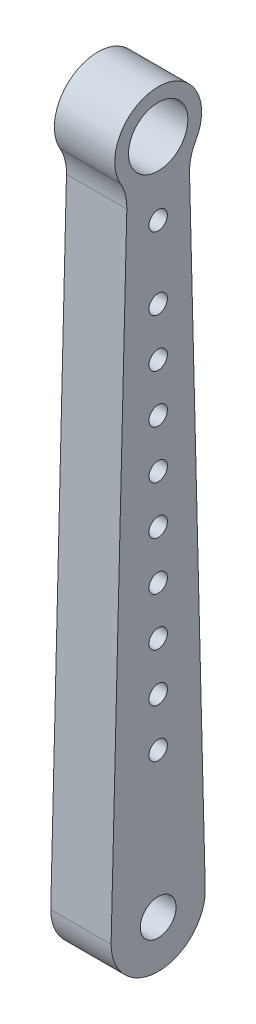
ISO-10303-21;
HEADER;
FILE_DESCRIPTION(('STEP AP214'),'2;1');
FILE_NAME('part.step','',(''),(''),'','','');
FILE_SCHEMA(('AUTOMOTIVE_DESIGN { 1 0 10303 214 1 1 1 1 }'));
ENDSEC;
DATA;
#1=APPLICATION_CONTEXT('core data for automotive mechanical design processes');
#2=APPLICATION_PROTOCOL_DEFINITION('international standard','automotive_design',2000,#1);
#3=PRODUCT_CONTEXT('',#1,'mechanical');
#4=PRODUCT('Part','Part','',(#3));
#5=PRODUCT_RELATED_PRODUCT_CATEGORY('part','',(#4));
#6=PRODUCT_DEFINITION_FORMATION('','',#4);
#7=PRODUCT_DEFINITION_CONTEXT('part definition',#1,'design');
#8=PRODUCT_DEFINITION('design','',#6,#7);
#9=PRODUCT_DEFINITION_SHAPE('','',#8);
#10=(LENGTH_UNIT() NAMED_UNIT(*) SI_UNIT(.MILLI.,.METRE.));
#11=(NAMED_UNIT(*) PLANE_ANGLE_UNIT() SI_UNIT($,.RADIAN.));
#12=(NAMED_UNIT(*) SI_UNIT($,.STERADIAN.) SOLID_ANGLE_UNIT());
#13=UNCERTAINTY_MEASURE_WITH_UNIT(LENGTH_MEASURE(1.E-05),#10,'distance_accuracy_value','');
#14=(GEOMETRIC_REPRESENTATION_CONTEXT(3) GLOBAL_UNCERTAINTY_ASSIGNED_CONTEXT((#13)) GLOBAL_UNIT_ASSIGNED_CONTEXT((#10,
#11,#12)) REPRESENTATION_CONTEXT('',''));
#15=CARTESIAN_POINT('',(0.,0.,0.));
#16=DIRECTION('',(0.,0.,1.));
#17=DIRECTION('',(1.,0.,0.));
#18=AXIS2_PLACEMENT_3D('',#15,#16,#17);
#19=CARTESIAN_POINT('',(-15.875,169.714598122893,8.1382092645095));
#20=DIRECTION('',(0.,0.0249999999999999,0.99968745115661));
#21=DIRECTION('',(0.,-0.99968745115661,0.0249999999999999));
#22=AXIS2_PLACEMENT_3D('',#19,#20,#21);
#23=PLANE('',#22);
#24=DIRECTION('',(0.,-0.99968745115661,0.0249999999999999));
#25=VECTOR('',#24,1.);
#26=CARTESIAN_POINT('',(0.,169.714598122893,8.1382092645095));
#27=LINE('',#26,#25);
#28=CARTESIAN_POINT('',(0.,165.434631554975,8.24524188162813));
#29=VERTEX_POINT('',#28);
#30=CARTESIAN_POINT('',(0.,0.,12.382400734717));
#31=VERTEX_POINT('',#30);
#32=EDGE_CURVE('E234',#29,#31,#27,.T.);
#33=ORIENTED_EDGE('',*,*,#32,.F.);
#34=DIRECTION('',(-1.,0.,0.));
#35=VECTOR('',#34,1.);
#36=CARTESIAN_POINT('',(-15.875,165.434631554975,8.24524188162813));
#37=LINE('',#36,#35);
#38=CARTESIAN_POINT('',(-15.875,165.434631554975,8.24524188162813));
#39=VERTEX_POINT('',#38);
#40=EDGE_CURVE('E52',#29,#39,#37,.T.);
#41=ORIENTED_EDGE('',*,*,#40,.T.);
#42=DIRECTION('',(0.,-0.99968745115661,0.0249999999999999));
#43=VECTOR('',#42,1.);
#44=CARTESIAN_POINT('',(-15.875,169.714598122893,8.1382092645095));
#45=LINE('',#44,#43);
#46=CARTESIAN_POINT('',(-15.875,0.,12.382400734717));
#47=VERTEX_POINT('',#46);
#48=EDGE_CURVE('E235',#39,#47,#45,.T.);
#49=ORIENTED_EDGE('',*,*,#48,.T.);
#50=DIRECTION('',(1.,0.,0.));
#51=VECTOR('',#50,1.);
#52=CARTESIAN_POINT('',(-15.875,0.,12.382400734717));
#53=LINE('',#52,#51);
#54=EDGE_CURVE('E188',#47,#31,#53,.T.);
#55=ORIENTED_EDGE('',*,*,#54,.T.);
#56=EDGE_LOOP('',(#33,#41,#49,#55));
#57=FACE_BOUND('',#56,.T.);
#58=ADVANCED_FACE('F37',(#57),#23,.T.);
#59=CARTESIAN_POINT('',(-15.875,177.740459445334,0.));
#60=DIRECTION('',(1.,0.,0.));
#61=DIRECTION('',(0.,0.,-1.));
#62=AXIS2_PLACEMENT_3D('',#59,#60,#61);
#63=CYLINDRICAL_SURFACE('',#62,11.43);
#64=CARTESIAN_POINT('',(0.,177.740459445334,0.));
#65=DIRECTION('',(1.,0.,0.));
#66=DIRECTION('',(0.,0.,-1.));
#67=AXIS2_PLACEMENT_3D('',#64,#65,#66);
#68=CIRCLE('',#67,11.43);
#69=CARTESIAN_POINT('',(0.,172.061777813059,-9.91955013693967));
#70=VERTEX_POINT('',#69);
#71=CARTESIAN_POINT('',(0.,172.061777813059,9.91955013693967));
#72=VERTEX_POINT('',#71);
#73=EDGE_CURVE('E238',#70,#72,#68,.T.);
#74=ORIENTED_EDGE('',*,*,#73,.F.);
#75=DIRECTION('',(1.,0.,0.));
#76=VECTOR('',#75,1.);
#77=CARTESIAN_POINT('',(-15.875,172.061777813059,-9.91955013693967));
#78=LINE('',#77,#76);
#79=CARTESIAN_POINT('',(-15.875,172.061777813059,-9.91955013693967));
#80=VERTEX_POINT('',#79);
#81=EDGE_CURVE('E257',#70,#80,#78,.F.);
#82=ORIENTED_EDGE('',*,*,#81,.T.);
#83=CARTESIAN_POINT('',(-15.875,177.740459445334,0.));
#84=DIRECTION('',(1.,0.,0.));
#85=DIRECTION('',(0.,0.,-1.));
#86=AXIS2_PLACEMENT_3D('',#83,#84,#85);
#87=CIRCLE('',#86,11.43);
#88=CARTESIAN_POINT('',(-15.875,172.061777813059,9.91955013693967));
#89=VERTEX_POINT('',#88);
#90=EDGE_CURVE('E241',#80,#89,#87,.T.);
#91=ORIENTED_EDGE('',*,*,#90,.T.);
#92=DIRECTION('',(1.,0.,0.));
#93=VECTOR('',#92,1.);
#94=CARTESIAN_POINT('',(-15.875,172.061777813059,9.91955013693967));
#95=LINE('',#94,#93);
#96=EDGE_CURVE('E254',#89,#72,#95,.T.);
#97=ORIENTED_EDGE('',*,*,#96,.T.);
#98=EDGE_LOOP('',(#74,#82,#91,#97));
#99=FACE_BOUND('',#98,.T.);
#100=ADVANCED_FACE('F281',(#99),#63,.T.);
#101=CARTESIAN_POINT('',(-15.875,169.714598122893,-8.1382092645095));
#102=DIRECTION('',(0.,0.0250000000000001,-0.99968745115661));
#103=DIRECTION('',(0.,0.99968745115661,0.0250000000000001));
#104=AXIS2_PLACEMENT_3D('',#101,#102,#103);
#105=PLANE('',#104);
#106=DIRECTION('',(0.,0.99968745115661,0.0250000000000001));
#107=VECTOR('',#106,1.);
#108=CARTESIAN_POINT('',(-15.875,169.714598122893,-8.1382092645095));
#109=LINE('',#108,#107);
#110=CARTESIAN_POINT('',(-15.875,0.,-12.382400734717));
#111=VERTEX_POINT('',#110);
#112=CARTESIAN_POINT('',(-15.875,165.434631554975,-8.24524188162814));
#113=VERTEX_POINT('',#112);
#114=EDGE_CURVE('E237',#111,#113,#109,.T.);
#115=ORIENTED_EDGE('',*,*,#114,.T.);
#116=DIRECTION('',(-1.,0.,0.));
#117=VECTOR('',#116,1.);
#118=CARTESIAN_POINT('',(0.,165.434631554975,-8.24524188162814));
#119=LINE('',#118,#117);
#120=CARTESIAN_POINT('',(0.,165.434631554975,-8.24524188162814));
#121=VERTEX_POINT('',#120);
#122=EDGE_CURVE('E244',#113,#121,#119,.F.);
#123=ORIENTED_EDGE('',*,*,#122,.T.);
#124=DIRECTION('',(0.,0.99968745115661,0.0250000000000001));
#125=VECTOR('',#124,1.);
#126=CARTESIAN_POINT('',(0.,169.714598122893,-8.1382092645095));
#127=LINE('',#126,#125);
#128=CARTESIAN_POINT('',(0.,0.,-12.382400734717));
#129=VERTEX_POINT('',#128);
#130=EDGE_CURVE('E246',#129,#121,#127,.T.);
#131=ORIENTED_EDGE('',*,*,#130,.F.);
#132=DIRECTION('',(1.,0.,0.));
#133=VECTOR('',#132,1.);
#134=CARTESIAN_POINT('',(-15.875,0.,-12.382400734717));
#135=LINE('',#134,#133);
#136=EDGE_CURVE('E191',#111,#129,#135,.T.);
#137=ORIENTED_EDGE('',*,*,#136,.F.);
#138=EDGE_LOOP('',(#115,#123,#131,#137));
#139=FACE_BOUND('',#138,.T.);
#140=ADVANCED_FACE('F273',(#139),#105,.T.);
#141=CARTESIAN_POINT('',(-15.875,177.740459445334,0.));
#142=DIRECTION('',(1.,0.,0.));
#143=DIRECTION('',(0.,0.,-1.));
#144=AXIS2_PLACEMENT_3D('',#141,#142,#143);
#145=PLANE('',#144);
#146=CARTESIAN_POINT('',(-15.875,177.8,0.));
#147=DIRECTION('',(1.,0.,0.));
#148=DIRECTION('',(0.,0.,-1.));
#149=AXIS2_PLACEMENT_3D('',#146,#147,#148);
#150=CIRCLE('',#149,7.8105);
#151=CARTESIAN_POINT('',(-15.875,177.8,-7.8105));
#152=VERTEX_POINT('',#151);
#153=EDGE_CURVE('E150',#152,#152,#150,.T.);
#154=ORIENTED_EDGE('',*,*,#153,.T.);
#155=EDGE_LOOP('',(#154));
#156=FACE_BOUND('',#155,.T.);
#157=DIRECTION('',(0.,-1.,0.));
#158=VECTOR('',#157,1.);
#159=CARTESIAN_POINT('',(-15.875,140.97,-6.35));
#160=LINE('',#159,#158);
#161=CARTESIAN_POINT('',(-15.875,140.97,-6.35));
#162=VERTEX_POINT('',#161);
#163=CARTESIAN_POINT('',(-15.875,31.75,-6.34999999999998));
#164=VERTEX_POINT('',#163);
#165=EDGE_CURVE('E149',#162,#164,#160,.T.);
#166=ORIENTED_EDGE('',*,*,#165,.F.);
#167=CARTESIAN_POINT('',(-15.875,140.97,0.));
#168=DIRECTION('',(-1.,0.,0.));
#169=DIRECTION('',(0.,0.,-1.));
#170=AXIS2_PLACEMENT_3D('',#167,#168,#169);
#171=CIRCLE('',#170,6.35);
#172=CARTESIAN_POINT('',(-15.875,140.97,6.35));
#173=VERTEX_POINT('',#172);
#174=EDGE_CURVE('E119',#173,#162,#171,.T.);
#175=ORIENTED_EDGE('',*,*,#174,.F.);
#176=DIRECTION('',(0.,1.,0.));
#177=VECTOR('',#176,1.);
#178=CARTESIAN_POINT('',(-15.875,140.97,6.35));
#179=LINE('',#178,#177);
#180=CARTESIAN_POINT('',(-15.875,31.75,6.35000000000002));
#181=VERTEX_POINT('',#180);
#182=EDGE_CURVE('E137',#181,#173,#179,.T.);
#183=ORIENTED_EDGE('',*,*,#182,.F.);
#184=CARTESIAN_POINT('',(-15.875,31.75,0.));
#185=DIRECTION('',(-1.,0.,0.));
#186=DIRECTION('',(0.,0.,1.));
#187=AXIS2_PLACEMENT_3D('',#184,#185,#186);
#188=CIRCLE('',#187,6.35);
#189=EDGE_CURVE('E140',#164,#181,#188,.T.);
#190=ORIENTED_EDGE('',*,*,#189,.F.);
#191=EDGE_LOOP('',(#166,#175,#183,#190));
#192=FACE_BOUND('',#191,.T.);
#193=CARTESIAN_POINT('',(-15.875,0.,0.));
#194=DIRECTION('',(1.,0.,0.));
#195=DIRECTION('',(0.,0.,-1.));
#196=AXIS2_PLACEMENT_3D('',#193,#194,#195);
#197=CIRCLE('',#196,4.7117);
#198=CARTESIAN_POINT('',(-15.875,0.,-4.7117));
#199=VERTEX_POINT('',#198);
#200=EDGE_CURVE('E198',#199,#199,#197,.F.);
#201=ORIENTED_EDGE('',*,*,#200,.F.);
#202=EDGE_LOOP('',(#201));
#203=FACE_BOUND('',#202,.T.);
#204=CARTESIAN_POINT('',(-15.875,158.75,0.));
#205=DIRECTION('',(1.,0.,0.));
#206=DIRECTION('',(0.,0.,-1.));
#207=AXIS2_PLACEMENT_3D('',#204,#205,#206);
#208=CIRCLE('',#207,2.413);
#209=CARTESIAN_POINT('',(-15.875,158.75,-2.413));
#210=VERTEX_POINT('',#209);
#211=EDGE_CURVE('E207',#210,#210,#208,.F.);
#212=ORIENTED_EDGE('',*,*,#211,.F.);
#213=EDGE_LOOP('',(#212));
#214=FACE_BOUND('',#213,.T.);
#215=ORIENTED_EDGE('',*,*,#114,.F.);
#216=CARTESIAN_POINT('',(-15.875,0.,0.));
#217=DIRECTION('',(-1.,0.,0.));
#218=DIRECTION('',(0.,0.,-1.));
#219=AXIS2_PLACEMENT_3D('',#216,#217,#218);
#220=CIRCLE('',#219,12.382400734717);
#221=EDGE_CURVE('E185',#111,#47,#220,.T.);
#222=ORIENTED_EDGE('',*,*,#221,.T.);
#223=ORIENTED_EDGE('',*,*,#48,.F.);
#224=CARTESIAN_POINT('',(-15.875,165.752131554975,20.9412725113171));
#225=DIRECTION('',(1.,0.,0.));
#226=DIRECTION('',(0.,0.,-1.));
#227=AXIS2_PLACEMENT_3D('',#224,#225,#226);
#228=CIRCLE('',#227,12.7);
#229=EDGE_CURVE('E11',#39,#89,#228,.T.);
#230=ORIENTED_EDGE('',*,*,#229,.T.);
#231=ORIENTED_EDGE('',*,*,#90,.F.);
#232=CARTESIAN_POINT('',(-15.875,165.752131554975,-20.9412725113171));
#233=DIRECTION('',(1.,0.,0.));
#234=DIRECTION('',(0.,0.,-1.));
#235=AXIS2_PLACEMENT_3D('',#232,#233,#234);
#236=CIRCLE('',#235,12.7);
#237=EDGE_CURVE('E262',#80,#113,#236,.T.);
#238=ORIENTED_EDGE('',*,*,#237,.T.);
#239=EDGE_LOOP('',(#215,#222,#223,#230,#231,#238));
#240=FACE_BOUND('',#239,.T.);
#241=ADVANCED_FACE('F267',(#156,#192,#203,#214,#240),#145,.F.);
#242=CARTESIAN_POINT('',(0.,177.740459445334,0.));
#243=DIRECTION('',(1.,0.,0.));
#244=DIRECTION('',(0.,0.,-1.));
#245=AXIS2_PLACEMENT_3D('',#242,#243,#244);
#246=PLANE('',#245);
#247=CARTESIAN_POINT('',(0.,177.8,0.));
#248=DIRECTION('',(1.,0.,0.));
#249=DIRECTION('',(0.,0.,-1.));
#250=AXIS2_PLACEMENT_3D('',#247,#248,#249);
#251=CIRCLE('',#250,7.8105);
#252=CARTESIAN_POINT('',(0.,177.8,-7.8105));
#253=VERTEX_POINT('',#252);
#254=EDGE_CURVE('E143',#253,#253,#251,.T.);
#255=ORIENTED_EDGE('',*,*,#254,.F.);
#256=EDGE_LOOP('',(#255));
#257=FACE_BOUND('',#256,.T.);
#258=CARTESIAN_POINT('',(0.,0.,0.));
#259=DIRECTION('',(-1.,0.,0.));
#260=DIRECTION('',(0.,0.,-1.));
#261=AXIS2_PLACEMENT_3D('',#258,#259,#260);
#262=CIRCLE('',#261,12.382400734717);
#263=EDGE_CURVE('E184',#129,#31,#262,.T.);
#264=ORIENTED_EDGE('',*,*,#263,.F.);
#265=ORIENTED_EDGE('',*,*,#130,.T.);
#266=CARTESIAN_POINT('',(0.,165.752131554975,-20.9412725113171));
#267=DIRECTION('',(1.,0.,0.));
#268=DIRECTION('',(0.,0.,-1.));
#269=AXIS2_PLACEMENT_3D('',#266,#267,#268);
#270=CIRCLE('',#269,12.7);
#271=EDGE_CURVE('E260',#121,#70,#270,.F.);
#272=ORIENTED_EDGE('',*,*,#271,.T.);
#273=ORIENTED_EDGE('',*,*,#73,.T.);
#274=CARTESIAN_POINT('',(0.,165.752131554975,20.9412725113171));
#275=DIRECTION('',(1.,0.,0.));
#276=DIRECTION('',(0.,0.,-1.));
#277=AXIS2_PLACEMENT_3D('',#274,#275,#276);
#278=CIRCLE('',#277,12.7);
#279=EDGE_CURVE('E45',#72,#29,#278,.F.);
#280=ORIENTED_EDGE('',*,*,#279,.T.);
#281=ORIENTED_EDGE('',*,*,#32,.T.);
#282=EDGE_LOOP('',(#264,#265,#272,#273,#280,#281));
#283=FACE_BOUND('',#282,.T.);
#284=CARTESIAN_POINT('',(0.,0.,0.));
#285=DIRECTION('',(1.,0.,0.));
#286=DIRECTION('',(0.,0.,-1.));
#287=AXIS2_PLACEMENT_3D('',#284,#285,#286);
#288=CIRCLE('',#287,4.7117);
#289=CARTESIAN_POINT('',(0.,0.,-4.7117));
#290=VERTEX_POINT('',#289);
#291=EDGE_CURVE('E193',#290,#290,#288,.T.);
#292=ORIENTED_EDGE('',*,*,#291,.F.);
#293=EDGE_LOOP('',(#292));
#294=FACE_BOUND('',#293,.T.);
#295=CARTESIAN_POINT('',(0.,38.1,0.));
#296=DIRECTION('',(1.,0.,0.));
#297=DIRECTION('',(0.,0.,-1.));
#298=AXIS2_PLACEMENT_3D('',#295,#296,#297);
#299=CIRCLE('',#298,2.413);
#300=CARTESIAN_POINT('',(0.,38.1,-2.413));
#301=VERTEX_POINT('',#300);
#302=EDGE_CURVE('E201',#301,#301,#299,.T.);
#303=ORIENTED_EDGE('',*,*,#302,.F.);
#304=EDGE_LOOP('',(#303));
#305=FACE_BOUND('',#304,.T.);
#306=CARTESIAN_POINT('',(0.,158.75,0.));
#307=DIRECTION('',(1.,0.,0.));
#308=DIRECTION('',(0.,0.,-1.));
#309=AXIS2_PLACEMENT_3D('',#306,#307,#308);
#310=CIRCLE('',#309,2.413);
#311=CARTESIAN_POINT('',(0.,158.75,-2.413));
#312=VERTEX_POINT('',#311);
#313=EDGE_CURVE('E204',#312,#312,#310,.T.);
#314=ORIENTED_EDGE('',*,*,#313,.F.);
#315=EDGE_LOOP('',(#314));
#316=FACE_BOUND('',#315,.T.);
#317=CARTESIAN_POINT('',(0.,139.7,0.));
#318=DIRECTION('',(1.,0.,0.));
#319=DIRECTION('',(0.,0.,-1.));
#320=AXIS2_PLACEMENT_3D('',#317,#318,#319);
#321=CIRCLE('',#320,2.413);
#322=CARTESIAN_POINT('',(0.,139.7,-2.413));
#323=VERTEX_POINT('',#322);
#324=EDGE_CURVE('E210',#323,#323,#321,.T.);
#325=ORIENTED_EDGE('',*,*,#324,.F.);
#326=EDGE_LOOP('',(#325));
#327=FACE_BOUND('',#326,.T.);
#328=CARTESIAN_POINT('',(0.,127.,0.));
#329=DIRECTION('',(1.,0.,0.));
#330=DIRECTION('',(0.,0.,-1.));
#331=AXIS2_PLACEMENT_3D('',#328,#329,#330);
#332=CIRCLE('',#331,2.413);
#333=CARTESIAN_POINT('',(0.,127.,-2.413));
#334=VERTEX_POINT('',#333);
#335=EDGE_CURVE('E213',#334,#334,#332,.T.);
#336=ORIENTED_EDGE('',*,*,#335,.F.);
#337=EDGE_LOOP('',(#336));
#338=FACE_BOUND('',#337,.T.);
#339=CARTESIAN_POINT('',(0.,114.3,0.));
#340=DIRECTION('',(1.,0.,0.));
#341=DIRECTION('',(0.,0.,-1.));
#342=AXIS2_PLACEMENT_3D('',#339,#340,#341);
#343=CIRCLE('',#342,2.413);
#344=CARTESIAN_POINT('',(0.,114.3,-2.413));
#345=VERTEX_POINT('',#344);
#346=EDGE_CURVE('E216',#345,#345,#343,.T.);
#347=ORIENTED_EDGE('',*,*,#346,.F.);
#348=EDGE_LOOP('',(#347));
#349=FACE_BOUND('',#348,.T.);
#350=CARTESIAN_POINT('',(0.,101.6,0.));
#351=DIRECTION('',(1.,0.,0.));
#352=DIRECTION('',(0.,0.,-1.));
#353=AXIS2_PLACEMENT_3D('',#350,#351,#352);
#354=CIRCLE('',#353,2.413);
#355=CARTESIAN_POINT('',(0.,101.6,-2.413));
#356=VERTEX_POINT('',#355);
#357=EDGE_CURVE('E219',#356,#356,#354,.T.);
#358=ORIENTED_EDGE('',*,*,#357,.F.);
#359=EDGE_LOOP('',(#358));
#360=FACE_BOUND('',#359,.T.);
#361=CARTESIAN_POINT('',(0.,88.9,0.));
#362=DIRECTION('',(1.,0.,0.));
#363=DIRECTION('',(0.,0.,-1.));
#364=AXIS2_PLACEMENT_3D('',#361,#362,#363);
#365=CIRCLE('',#364,2.413);
#366=CARTESIAN_POINT('',(0.,88.9,-2.413));
#367=VERTEX_POINT('',#366);
#368=EDGE_CURVE('E222',#367,#367,#365,.T.);
#369=ORIENTED_EDGE('',*,*,#368,.F.);
#370=EDGE_LOOP('',(#369));
#371=FACE_BOUND('',#370,.T.);
#372=CARTESIAN_POINT('',(0.,76.2,0.));
#373=DIRECTION('',(1.,0.,0.));
#374=DIRECTION('',(0.,0.,-1.));
#375=AXIS2_PLACEMENT_3D('',#372,#373,#374);
#376=CIRCLE('',#375,2.413);
#377=CARTESIAN_POINT('',(0.,76.2,-2.413));
#378=VERTEX_POINT('',#377);
#379=EDGE_CURVE('E225',#378,#378,#376,.T.);
#380=ORIENTED_EDGE('',*,*,#379,.F.);
#381=EDGE_LOOP('',(#380));
#382=FACE_BOUND('',#381,.T.);
#383=CARTESIAN_POINT('',(0.,63.5,0.));
#384=DIRECTION('',(1.,0.,0.));
#385=DIRECTION('',(0.,0.,-1.));
#386=AXIS2_PLACEMENT_3D('',#383,#384,#385);
#387=CIRCLE('',#386,2.413);
#388=CARTESIAN_POINT('',(0.,63.5,-2.413));
#389=VERTEX_POINT('',#388);
#390=EDGE_CURVE('E228',#389,#389,#387,.T.);
#391=ORIENTED_EDGE('',*,*,#390,.F.);
#392=EDGE_LOOP('',(#391));
#393=FACE_BOUND('',#392,.T.);
#394=CARTESIAN_POINT('',(0.,50.8,0.));
#395=DIRECTION('',(1.,0.,0.));
#396=DIRECTION('',(0.,0.,-1.));
#397=AXIS2_PLACEMENT_3D('',#394,#395,#396);
#398=CIRCLE('',#397,2.413);
#399=CARTESIAN_POINT('',(0.,50.8,-2.413));
#400=VERTEX_POINT('',#399);
#401=EDGE_CURVE('E231',#400,#400,#398,.T.);
#402=ORIENTED_EDGE('',*,*,#401,.F.);
#403=EDGE_LOOP('',(#402));
#404=FACE_BOUND('',#403,.T.);
#405=ADVANCED_FACE('F278',(#257,#283,#294,#305,#316,#327,#338,#349,#360,#371,#382,#393,#404),
#246,.T.);
#406=CARTESIAN_POINT('',(-15.876,50.8,0.));
#407=DIRECTION('',(1.,0.,0.));
#408=DIRECTION('',(0.,0.,-1.));
#409=AXIS2_PLACEMENT_3D('',#406,#407,#408);
#410=CYLINDRICAL_SURFACE('',#409,2.413);
#411=CARTESIAN_POINT('',(-8.255,50.8,0.));
#412=DIRECTION('',(1.,0.,0.));
#413=DIRECTION('',(0.,0.,-1.));
#414=AXIS2_PLACEMENT_3D('',#411,#412,#413);
#415=CIRCLE('',#414,2.413);
#416=CARTESIAN_POINT('',(-8.255,50.8,-2.413));
#417=VERTEX_POINT('',#416);
#418=EDGE_CURVE('E181',#417,#417,#415,.F.);
#419=ORIENTED_EDGE('',*,*,#418,.T.);
#420=EDGE_LOOP('',(#419));
#421=FACE_BOUND('',#420,.T.);
#422=ORIENTED_EDGE('',*,*,#401,.T.);
#423=EDGE_LOOP('',(#422));
#424=FACE_BOUND('',#423,.T.);
#425=ADVANCED_FACE('F386',(#421,#424),#410,.F.);
#426=CARTESIAN_POINT('',(-15.876,63.5,0.));
#427=DIRECTION('',(1.,0.,0.));
#428=DIRECTION('',(0.,0.,-1.));
#429=AXIS2_PLACEMENT_3D('',#426,#427,#428);
#430=CYLINDRICAL_SURFACE('',#429,2.413);
#431=CARTESIAN_POINT('',(-8.255,63.5,0.));
#432=DIRECTION('',(1.,0.,0.));
#433=DIRECTION('',(0.,0.,-1.));
#434=AXIS2_PLACEMENT_3D('',#431,#432,#433);
#435=CIRCLE('',#434,2.413);
#436=CARTESIAN_POINT('',(-8.255,63.5,-2.413));
#437=VERTEX_POINT('',#436);
#438=EDGE_CURVE('E178',#437,#437,#435,.F.);
#439=ORIENTED_EDGE('',*,*,#438,.T.);
#440=EDGE_LOOP('',(#439));
#441=FACE_BOUND('',#440,.T.);
#442=ORIENTED_EDGE('',*,*,#390,.T.);
#443=EDGE_LOOP('',(#442));
#444=FACE_BOUND('',#443,.T.);
#445=ADVANCED_FACE('F406',(#441,#444),#430,.F.);
#446=CARTESIAN_POINT('',(-15.876,76.2,0.));
#447=DIRECTION('',(1.,0.,0.));
#448=DIRECTION('',(0.,0.,-1.));
#449=AXIS2_PLACEMENT_3D('',#446,#447,#448);
#450=CYLINDRICAL_SURFACE('',#449,2.413);
#451=CARTESIAN_POINT('',(-8.255,76.2,0.));
#452=DIRECTION('',(1.,0.,0.));
#453=DIRECTION('',(0.,0.,-1.));
#454=AXIS2_PLACEMENT_3D('',#451,#452,#453);
#455=CIRCLE('',#454,2.413);
#456=CARTESIAN_POINT('',(-8.255,76.2,-2.413));
#457=VERTEX_POINT('',#456);
#458=EDGE_CURVE('E175',#457,#457,#455,.F.);
#459=ORIENTED_EDGE('',*,*,#458,.T.);
#460=EDGE_LOOP('',(#459));
#461=FACE_BOUND('',#460,.T.);
#462=ORIENTED_EDGE('',*,*,#379,.T.);
#463=EDGE_LOOP('',(#462));
#464=FACE_BOUND('',#463,.T.);
#465=ADVANCED_FACE('F413',(#461,#464),#450,.F.);
#466=CARTESIAN_POINT('',(-15.876,88.9,0.));
#467=DIRECTION('',(1.,0.,0.));
#468=DIRECTION('',(0.,0.,-1.));
#469=AXIS2_PLACEMENT_3D('',#466,#467,#468);
#470=CYLINDRICAL_SURFACE('',#469,2.413);
#471=CARTESIAN_POINT('',(-8.255,88.9,0.));
#472=DIRECTION('',(1.,0.,0.));
#473=DIRECTION('',(0.,0.,-1.));
#474=AXIS2_PLACEMENT_3D('',#471,#472,#473);
#475=CIRCLE('',#474,2.413);
#476=CARTESIAN_POINT('',(-8.255,88.9,-2.413));
#477=VERTEX_POINT('',#476);
#478=EDGE_CURVE('E172',#477,#477,#475,.F.);
#479=ORIENTED_EDGE('',*,*,#478,.T.);
#480=EDGE_LOOP('',(#479));
#481=FACE_BOUND('',#480,.T.);
#482=ORIENTED_EDGE('',*,*,#368,.T.);
#483=EDGE_LOOP('',(#482));
#484=FACE_BOUND('',#483,.T.);
#485=ADVANCED_FACE('F421',(#481,#484),#470,.F.);
#486=CARTESIAN_POINT('',(-15.876,101.6,0.));
#487=DIRECTION('',(1.,0.,0.));
#488=DIRECTION('',(0.,0.,-1.));
#489=AXIS2_PLACEMENT_3D('',#486,#487,#488);
#490=CYLINDRICAL_SURFACE('',#489,2.413);
#491=CARTESIAN_POINT('',(-8.255,101.6,0.));
#492=DIRECTION('',(1.,0.,0.));
#493=DIRECTION('',(0.,0.,-1.));
#494=AXIS2_PLACEMENT_3D('',#491,#492,#493);
#495=CIRCLE('',#494,2.413);
#496=CARTESIAN_POINT('',(-8.255,101.6,-2.413));
#497=VERTEX_POINT('',#496);
#498=EDGE_CURVE('E169',#497,#497,#495,.F.);
#499=ORIENTED_EDGE('',*,*,#498,.T.);
#500=EDGE_LOOP('',(#499));
#501=FACE_BOUND('',#500,.T.);
#502=ORIENTED_EDGE('',*,*,#357,.T.);
#503=EDGE_LOOP('',(#502));
#504=FACE_BOUND('',#503,.T.);
#505=ADVANCED_FACE('F429',(#501,#504),#490,.F.);
#506=CARTESIAN_POINT('',(-15.876,114.3,0.));
#507=DIRECTION('',(1.,0.,0.));
#508=DIRECTION('',(0.,0.,-1.));
#509=AXIS2_PLACEMENT_3D('',#506,#507,#508);
#510=CYLINDRICAL_SURFACE('',#509,2.413);
#511=CARTESIAN_POINT('',(-8.255,114.3,0.));
#512=DIRECTION('',(1.,0.,0.));
#513=DIRECTION('',(0.,0.,-1.));
#514=AXIS2_PLACEMENT_3D('',#511,#512,#513);
#515=CIRCLE('',#514,2.413);
#516=CARTESIAN_POINT('',(-8.255,114.3,-2.413));
#517=VERTEX_POINT('',#516);
#518=EDGE_CURVE('E166',#517,#517,#515,.F.);
#519=ORIENTED_EDGE('',*,*,#518,.T.);
#520=EDGE_LOOP('',(#519));
#521=FACE_BOUND('',#520,.T.);
#522=ORIENTED_EDGE('',*,*,#346,.T.);
#523=EDGE_LOOP('',(#522));
#524=FACE_BOUND('',#523,.T.);
#525=ADVANCED_FACE('F437',(#521,#524),#510,.F.);
#526=CARTESIAN_POINT('',(-15.876,127.,0.));
#527=DIRECTION('',(1.,0.,0.));
#528=DIRECTION('',(0.,0.,-1.));
#529=AXIS2_PLACEMENT_3D('',#526,#527,#528);
#530=CYLINDRICAL_SURFACE('',#529,2.413);
#531=CARTESIAN_POINT('',(-8.255,127.,0.));
#532=DIRECTION('',(1.,0.,0.));
#533=DIRECTION('',(0.,0.,-1.));
#534=AXIS2_PLACEMENT_3D('',#531,#532,#533);
#535=CIRCLE('',#534,2.413);
#536=CARTESIAN_POINT('',(-8.255,127.,-2.413));
#537=VERTEX_POINT('',#536);
#538=EDGE_CURVE('E163',#537,#537,#535,.F.);
#539=ORIENTED_EDGE('',*,*,#538,.T.);
#540=EDGE_LOOP('',(#539));
#541=FACE_BOUND('',#540,.T.);
#542=ORIENTED_EDGE('',*,*,#335,.T.);
#543=EDGE_LOOP('',(#542));
#544=FACE_BOUND('',#543,.T.);
#545=ADVANCED_FACE('F445',(#541,#544),#530,.F.);
#546=CARTESIAN_POINT('',(-15.876,139.7,0.));
#547=DIRECTION('',(1.,0.,0.));
#548=DIRECTION('',(0.,0.,-1.));
#549=AXIS2_PLACEMENT_3D('',#546,#547,#548);
#550=CYLINDRICAL_SURFACE('',#549,2.413);
#551=CARTESIAN_POINT('',(-8.255,139.7,0.));
#552=DIRECTION('',(1.,0.,0.));
#553=DIRECTION('',(0.,0.,-1.));
#554=AXIS2_PLACEMENT_3D('',#551,#552,#553);
#555=CIRCLE('',#554,2.413);
#556=CARTESIAN_POINT('',(-8.255,139.7,-2.413));
#557=VERTEX_POINT('',#556);
#558=EDGE_CURVE('E160',#557,#557,#555,.F.);
#559=ORIENTED_EDGE('',*,*,#558,.T.);
#560=EDGE_LOOP('',(#559));
#561=FACE_BOUND('',#560,.T.);
#562=ORIENTED_EDGE('',*,*,#324,.T.);
#563=EDGE_LOOP('',(#562));
#564=FACE_BOUND('',#563,.T.);
#565=ADVANCED_FACE('F453',(#561,#564),#550,.F.);
#566=CARTESIAN_POINT('',(-15.876,158.75,0.));
#567=DIRECTION('',(1.,0.,0.));
#568=DIRECTION('',(0.,0.,-1.));
#569=AXIS2_PLACEMENT_3D('',#566,#567,#568);
#570=CYLINDRICAL_SURFACE('',#569,2.413);
#571=ORIENTED_EDGE('',*,*,#313,.T.);
#572=EDGE_LOOP('',(#571));
#573=FACE_BOUND('',#572,.T.);
#574=ORIENTED_EDGE('',*,*,#211,.T.);
#575=EDGE_LOOP('',(#574));
#576=FACE_BOUND('',#575,.T.);
#577=ADVANCED_FACE('F461',(#573,#576),#570,.F.);
#578=CARTESIAN_POINT('',(-15.876,38.1,0.));
#579=DIRECTION('',(1.,0.,0.));
#580=DIRECTION('',(0.,0.,-1.));
#581=AXIS2_PLACEMENT_3D('',#578,#579,#580);
#582=CYLINDRICAL_SURFACE('',#581,2.413);
#583=CARTESIAN_POINT('',(-8.255,38.1,0.));
#584=DIRECTION('',(1.,0.,0.));
#585=DIRECTION('',(0.,0.,-1.));
#586=AXIS2_PLACEMENT_3D('',#583,#584,#585);
#587=CIRCLE('',#586,2.413);
#588=CARTESIAN_POINT('',(-8.255,38.1,-2.413));
#589=VERTEX_POINT('',#588);
#590=EDGE_CURVE('E156',#589,#589,#587,.F.);
#591=ORIENTED_EDGE('',*,*,#590,.T.);
#592=EDGE_LOOP('',(#591));
#593=FACE_BOUND('',#592,.T.);
#594=ORIENTED_EDGE('',*,*,#302,.T.);
#595=EDGE_LOOP('',(#594));
#596=FACE_BOUND('',#595,.T.);
#597=ADVANCED_FACE('F297',(#593,#596),#582,.F.);
#598=CARTESIAN_POINT('',(-15.876,0.,0.));
#599=DIRECTION('',(1.,0.,0.));
#600=DIRECTION('',(0.,0.,-1.));
#601=AXIS2_PLACEMENT_3D('',#598,#599,#600);
#602=CYLINDRICAL_SURFACE('',#601,4.7117);
#603=ORIENTED_EDGE('',*,*,#291,.T.);
#604=EDGE_LOOP('',(#603));
#605=FACE_BOUND('',#604,.T.);
#606=ORIENTED_EDGE('',*,*,#200,.T.);
#607=EDGE_LOOP('',(#606));
#608=FACE_BOUND('',#607,.T.);
#609=ADVANCED_FACE('F289',(#605,#608),#602,.F.);
#610=CARTESIAN_POINT('',(-15.875,0.,0.));
#611=DIRECTION('',(1.,0.,0.));
#612=DIRECTION('',(0.,0.,-1.));
#613=AXIS2_PLACEMENT_3D('',#610,#611,#612);
#614=CYLINDRICAL_SURFACE('',#613,12.382400734717);
#615=ORIENTED_EDGE('',*,*,#263,.T.);
#616=ORIENTED_EDGE('',*,*,#54,.F.);
#617=ORIENTED_EDGE('',*,*,#221,.F.);
#618=ORIENTED_EDGE('',*,*,#136,.T.);
#619=EDGE_LOOP('',(#615,#616,#617,#618));
#620=FACE_BOUND('',#619,.T.);
#621=ADVANCED_FACE('F287',(#620),#614,.T.);
#622=CARTESIAN_POINT('',(-8.255,140.97,0.));
#623=DIRECTION('',(1.,0.,0.));
#624=DIRECTION('',(0.,0.,-1.));
#625=AXIS2_PLACEMENT_3D('',#622,#623,#624);
#626=PLANE('',#625);
#627=ORIENTED_EDGE('',*,*,#438,.F.);
#628=EDGE_LOOP('',(#627));
#629=FACE_BOUND('',#628,.T.);
#630=ORIENTED_EDGE('',*,*,#478,.F.);
#631=EDGE_LOOP('',(#630));
#632=FACE_BOUND('',#631,.T.);
#633=ORIENTED_EDGE('',*,*,#518,.F.);
#634=EDGE_LOOP('',(#633));
#635=FACE_BOUND('',#634,.T.);
#636=ORIENTED_EDGE('',*,*,#558,.F.);
#637=EDGE_LOOP('',(#636));
#638=FACE_BOUND('',#637,.T.);
#639=CARTESIAN_POINT('',(-8.255,140.97,0.));
#640=DIRECTION('',(-1.,0.,0.));
#641=DIRECTION('',(0.,0.,-1.));
#642=AXIS2_PLACEMENT_3D('',#639,#640,#641);
#643=CIRCLE('',#642,6.35);
#644=CARTESIAN_POINT('',(-8.255,140.97,6.35));
#645=VERTEX_POINT('',#644);
#646=CARTESIAN_POINT('',(-8.255,140.97,-6.35));
#647=VERTEX_POINT('',#646);
#648=EDGE_CURVE('E116',#645,#647,#643,.T.);
#649=ORIENTED_EDGE('',*,*,#648,.T.);
#650=DIRECTION('',(0.,-1.,0.));
#651=VECTOR('',#650,1.);
#652=CARTESIAN_POINT('',(-8.255,140.97,-6.35));
#653=LINE('',#652,#651);
#654=CARTESIAN_POINT('',(-8.255,31.75,-6.34999999999998));
#655=VERTEX_POINT('',#654);
#656=EDGE_CURVE('E127',#647,#655,#653,.T.);
#657=ORIENTED_EDGE('',*,*,#656,.T.);
#658=CARTESIAN_POINT('',(-8.255,31.75,0.));
#659=DIRECTION('',(-1.,0.,0.));
#660=DIRECTION('',(0.,0.,1.));
#661=AXIS2_PLACEMENT_3D('',#658,#659,#660);
#662=CIRCLE('',#661,6.35);
#663=CARTESIAN_POINT('',(-8.255,31.75,6.35000000000002));
#664=VERTEX_POINT('',#663);
#665=EDGE_CURVE('E132',#655,#664,#662,.T.);
#666=ORIENTED_EDGE('',*,*,#665,.T.);
#667=DIRECTION('',(0.,1.,0.));
#668=VECTOR('',#667,1.);
#669=CARTESIAN_POINT('',(-8.255,140.97,6.35));
#670=LINE('',#669,#668);
#671=EDGE_CURVE('E124',#664,#645,#670,.T.);
#672=ORIENTED_EDGE('',*,*,#671,.T.);
#673=EDGE_LOOP('',(#649,#657,#666,#672));
#674=FACE_BOUND('',#673,.T.);
#675=ORIENTED_EDGE('',*,*,#590,.F.);
#676=EDGE_LOOP('',(#675));
#677=FACE_BOUND('',#676,.T.);
#678=ORIENTED_EDGE('',*,*,#538,.F.);
#679=EDGE_LOOP('',(#678));
#680=FACE_BOUND('',#679,.T.);
#681=ORIENTED_EDGE('',*,*,#498,.F.);
#682=EDGE_LOOP('',(#681));
#683=FACE_BOUND('',#682,.T.);
#684=ORIENTED_EDGE('',*,*,#458,.F.);
#685=EDGE_LOOP('',(#684));
#686=FACE_BOUND('',#685,.T.);
#687=ORIENTED_EDGE('',*,*,#418,.F.);
#688=EDGE_LOOP('',(#687));
#689=FACE_BOUND('',#688,.T.);
#690=ADVANCED_FACE('F134',(#629,#632,#635,#638,#674,#677,#680,#683,#686,#689),#626,.F.);
#691=CARTESIAN_POINT('',(-8.255,140.97,0.));
#692=DIRECTION('',(-1.,0.,0.));
#693=DIRECTION('',(0.,0.,1.));
#694=AXIS2_PLACEMENT_3D('',#691,#692,#693);
#695=CYLINDRICAL_SURFACE('',#694,6.35);
#696=ORIENTED_EDGE('',*,*,#174,.T.);
#697=DIRECTION('',(-1.,0.,0.));
#698=VECTOR('',#697,1.);
#699=CARTESIAN_POINT('',(-8.255,140.97,-6.35));
#700=LINE('',#699,#698);
#701=EDGE_CURVE('E112',#647,#162,#700,.T.);
#702=ORIENTED_EDGE('',*,*,#701,.F.);
#703=ORIENTED_EDGE('',*,*,#648,.F.);
#704=DIRECTION('',(-1.,0.,0.));
#705=VECTOR('',#704,1.);
#706=CARTESIAN_POINT('',(-8.255,140.97,6.35));
#707=LINE('',#706,#705);
#708=EDGE_CURVE('E154',#645,#173,#707,.T.);
#709=ORIENTED_EDGE('',*,*,#708,.T.);
#710=EDGE_LOOP('',(#696,#702,#703,#709));
#711=FACE_BOUND('',#710,.T.);
#712=ADVANCED_FACE('F114',(#711),#695,.F.);
#713=CARTESIAN_POINT('',(-8.255,140.97,6.35));
#714=DIRECTION('',(0.,0.,1.));
#715=DIRECTION('',(0.,-1.,0.));
#716=AXIS2_PLACEMENT_3D('',#713,#714,#715);
#717=PLANE('',#716);
#718=ORIENTED_EDGE('',*,*,#182,.T.);
#719=ORIENTED_EDGE('',*,*,#708,.F.);
#720=ORIENTED_EDGE('',*,*,#671,.F.);
#721=DIRECTION('',(-1.,0.,0.));
#722=VECTOR('',#721,1.);
#723=CARTESIAN_POINT('',(-8.255,31.75,6.35000000000002));
#724=LINE('',#723,#722);
#725=EDGE_CURVE('E157',#664,#181,#724,.T.);
#726=ORIENTED_EDGE('',*,*,#725,.T.);
#727=EDGE_LOOP('',(#718,#719,#720,#726));
#728=FACE_BOUND('',#727,.T.);
#729=ADVANCED_FACE('F324',(#728),#717,.F.);
#730=CARTESIAN_POINT('',(-8.255,31.75,0.));
#731=DIRECTION('',(-1.,0.,0.));
#732=DIRECTION('',(0.,0.,1.));
#733=AXIS2_PLACEMENT_3D('',#730,#731,#732);
#734=CYLINDRICAL_SURFACE('',#733,6.35);
#735=ORIENTED_EDGE('',*,*,#189,.T.);
#736=ORIENTED_EDGE('',*,*,#725,.F.);
#737=ORIENTED_EDGE('',*,*,#665,.F.);
#738=DIRECTION('',(-1.,0.,0.));
#739=VECTOR('',#738,1.);
#740=CARTESIAN_POINT('',(-8.255,31.75,-6.34999999999998));
#741=LINE('',#740,#739);
#742=EDGE_CURVE('E123',#655,#164,#741,.T.);
#743=ORIENTED_EDGE('',*,*,#742,.T.);
#744=EDGE_LOOP('',(#735,#736,#737,#743));
#745=FACE_BOUND('',#744,.T.);
#746=ADVANCED_FACE('F319',(#745),#734,.F.);
#747=CARTESIAN_POINT('',(-8.255,140.97,-6.35));
#748=DIRECTION('',(0.,0.,-1.));
#749=DIRECTION('',(0.,1.,0.));
#750=AXIS2_PLACEMENT_3D('',#747,#748,#749);
#751=PLANE('',#750);
#752=ORIENTED_EDGE('',*,*,#165,.T.);
#753=ORIENTED_EDGE('',*,*,#742,.F.);
#754=ORIENTED_EDGE('',*,*,#656,.F.);
#755=ORIENTED_EDGE('',*,*,#701,.T.);
#756=EDGE_LOOP('',(#752,#753,#754,#755));
#757=FACE_BOUND('',#756,.T.);
#758=ADVANCED_FACE('F128',(#757),#751,.F.);
#759=CARTESIAN_POINT('',(-15.875,177.8,0.));
#760=DIRECTION('',(1.,0.,0.));
#761=DIRECTION('',(0.,0.,-1.));
#762=AXIS2_PLACEMENT_3D('',#759,#760,#761);
#763=CYLINDRICAL_SURFACE('',#762,7.8105);
#764=ORIENTED_EDGE('',*,*,#153,.F.);
#765=EDGE_LOOP('',(#764));
#766=FACE_BOUND('',#765,.T.);
#767=ORIENTED_EDGE('',*,*,#254,.T.);
#768=EDGE_LOOP('',(#767));
#769=FACE_BOUND('',#768,.T.);
#770=ADVANCED_FACE('F309',(#766,#769),#763,.F.);
#771=CARTESIAN_POINT('',(-15.875,165.752131554975,-20.9412725113171));
#772=DIRECTION('',(1.,0.,0.));
#773=DIRECTION('',(0.,0.,-1.));
#774=AXIS2_PLACEMENT_3D('',#771,#772,#773);
#775=CYLINDRICAL_SURFACE('',#774,12.7);
#776=ORIENTED_EDGE('',*,*,#237,.F.);
#777=ORIENTED_EDGE('',*,*,#81,.F.);
#778=ORIENTED_EDGE('',*,*,#271,.F.);
#779=ORIENTED_EDGE('',*,*,#122,.F.);
#780=EDGE_LOOP('',(#776,#777,#778,#779));
#781=FACE_BOUND('',#780,.T.);
#782=ADVANCED_FACE('F275',(#781),#775,.F.);
#783=CARTESIAN_POINT('',(-15.875,165.752131554975,20.9412725113171));
#784=DIRECTION('',(1.,0.,0.));
#785=DIRECTION('',(0.,0.,-1.));
#786=AXIS2_PLACEMENT_3D('',#783,#784,#785);
#787=CYLINDRICAL_SURFACE('',#786,12.7);
#788=ORIENTED_EDGE('',*,*,#229,.F.);
#789=ORIENTED_EDGE('',*,*,#40,.F.);
#790=ORIENTED_EDGE('',*,*,#279,.F.);
#791=ORIENTED_EDGE('',*,*,#96,.F.);
#792=EDGE_LOOP('',(#788,#789,#790,#791));
#793=FACE_BOUND('',#792,.T.);
#794=ADVANCED_FACE('F39',(#793),#787,.F.);
#795=CLOSED_SHELL('',(#58,#100,#140,#241,#405,#425,#445,#465,#485,#505,#525,#545,#565,#577,#597,
#609,#621,#690,#712,#729,#746,#758,#770,#782,#794));
#796=MANIFOLD_SOLID_BREP('B2',#795);
#797=ADVANCED_BREP_SHAPE_REPRESENTATION('',(#18,#796),#14);
#798=SHAPE_DEFINITION_REPRESENTATION(#9,#797);
ENDSEC;
END-ISO-10303-21;
